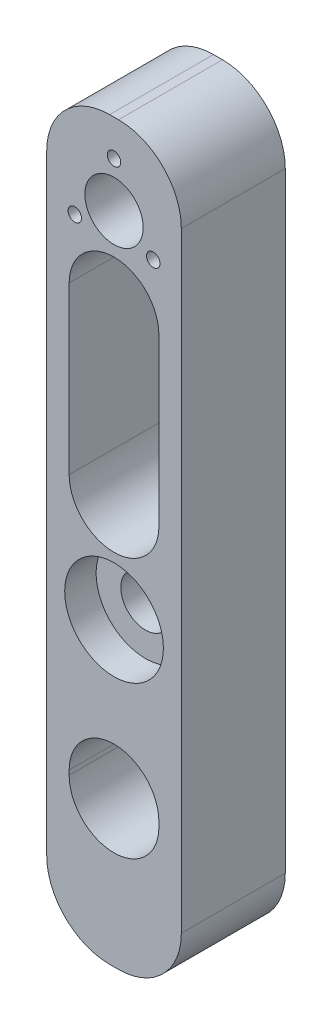
ISO-10303-21;
HEADER;
FILE_DESCRIPTION(('STEP AP214'),'2;1');
FILE_NAME('part.step','',(''),(''),'','','');
FILE_SCHEMA(('AUTOMOTIVE_DESIGN { 1 0 10303 214 1 1 1 1 }'));
ENDSEC;
DATA;
#1=APPLICATION_CONTEXT('core data for automotive mechanical design processes');
#2=APPLICATION_PROTOCOL_DEFINITION('international standard','automotive_design',2000,#1);
#3=PRODUCT_CONTEXT('',#1,'mechanical');
#4=PRODUCT('Part','Part','',(#3));
#5=PRODUCT_RELATED_PRODUCT_CATEGORY('part','',(#4));
#6=PRODUCT_DEFINITION_FORMATION('','',#4);
#7=PRODUCT_DEFINITION_CONTEXT('part definition',#1,'design');
#8=PRODUCT_DEFINITION('design','',#6,#7);
#9=PRODUCT_DEFINITION_SHAPE('','',#8);
#10=(LENGTH_UNIT() NAMED_UNIT(*) SI_UNIT(.MILLI.,.METRE.));
#11=(NAMED_UNIT(*) PLANE_ANGLE_UNIT() SI_UNIT($,.RADIAN.));
#12=(NAMED_UNIT(*) SI_UNIT($,.STERADIAN.) SOLID_ANGLE_UNIT());
#13=UNCERTAINTY_MEASURE_WITH_UNIT(LENGTH_MEASURE(1.E-05),#10,'distance_accuracy_value','');
#14=(GEOMETRIC_REPRESENTATION_CONTEXT(3) GLOBAL_UNCERTAINTY_ASSIGNED_CONTEXT((#13)) GLOBAL_UNIT_ASSIGNED_CONTEXT((#10,
#11,#12)) REPRESENTATION_CONTEXT('',''));
#15=CARTESIAN_POINT('',(0.,0.,0.));
#16=DIRECTION('',(0.,0.,1.));
#17=DIRECTION('',(1.,0.,0.));
#18=AXIS2_PLACEMENT_3D('',#15,#16,#17);
#19=CARTESIAN_POINT('',(0.,50.,23.1638));
#20=DIRECTION('',(0.,0.,-1.));
#21=DIRECTION('',(-1.,0.,0.));
#22=AXIS2_PLACEMENT_3D('',#19,#20,#21);
#23=CYLINDRICAL_SURFACE('',#22,11.);
#24=CARTESIAN_POINT('',(0.,50.,23.1638));
#25=DIRECTION('',(0.,0.,1.));
#26=DIRECTION('',(1.,0.,0.));
#27=AXIS2_PLACEMENT_3D('',#24,#25,#26);
#28=CIRCLE('',#27,11.);
#29=CARTESIAN_POINT('',(11.,50.,23.1638));
#30=VERTEX_POINT('',#29);
#31=EDGE_CURVE('E248',#30,#30,#28,.T.);
#32=ORIENTED_EDGE('',*,*,#31,.T.);
#33=EDGE_LOOP('',(#32));
#34=FACE_BOUND('',#33,.T.);
#35=CARTESIAN_POINT('',(0.,50.,16.1638));
#36=DIRECTION('',(0.,0.,-1.));
#37=DIRECTION('',(-1.,0.,0.));
#38=AXIS2_PLACEMENT_3D('',#35,#36,#37);
#39=CIRCLE('',#38,11.);
#40=CARTESIAN_POINT('',(-11.,50.,16.1638));
#41=VERTEX_POINT('',#40);
#42=EDGE_CURVE('E237',#41,#41,#39,.T.);
#43=ORIENTED_EDGE('',*,*,#42,.T.);
#44=EDGE_LOOP('',(#43));
#45=FACE_BOUND('',#44,.T.);
#46=ADVANCED_FACE('F33',(#34,#45),#23,.F.);
#47=CARTESIAN_POINT('',(0.,0.,23.1638));
#48=DIRECTION('',(0.,0.,1.));
#49=DIRECTION('',(1.,0.,0.));
#50=AXIS2_PLACEMENT_3D('',#47,#48,#49);
#51=PLANE('',#50);
#52=CARTESIAN_POINT('',(0.,110.,23.1638));
#53=DIRECTION('',(0.,0.,1.));
#54=DIRECTION('',(1.,0.,0.));
#55=AXIS2_PLACEMENT_3D('',#52,#53,#54);
#56=CIRCLE('',#55,10.);
#57=CARTESIAN_POINT('',(10.,110.,23.1638));
#58=VERTEX_POINT('',#57);
#59=CARTESIAN_POINT('',(-10.,110.,23.1638));
#60=VERTEX_POINT('',#59);
#61=EDGE_CURVE('E168',#58,#60,#56,.T.);
#62=ORIENTED_EDGE('',*,*,#61,.F.);
#63=DIRECTION('',(0.,1.,0.));
#64=VECTOR('',#63,1.);
#65=CARTESIAN_POINT('',(10.,110.,23.1638));
#66=LINE('',#65,#64);
#67=CARTESIAN_POINT('',(10.,73.,23.1638));
#68=VERTEX_POINT('',#67);
#69=EDGE_CURVE('E173',#68,#58,#66,.T.);
#70=ORIENTED_EDGE('',*,*,#69,.F.);
#71=CARTESIAN_POINT('',(0.,73.,23.1638));
#72=DIRECTION('',(0.,0.,1.));
#73=DIRECTION('',(1.,0.,0.));
#74=AXIS2_PLACEMENT_3D('',#71,#72,#73);
#75=CIRCLE('',#74,10.);
#76=CARTESIAN_POINT('',(-10.,73.,23.1638));
#77=VERTEX_POINT('',#76);
#78=EDGE_CURVE('E152',#77,#68,#75,.T.);
#79=ORIENTED_EDGE('',*,*,#78,.F.);
#80=DIRECTION('',(0.,-1.,0.));
#81=VECTOR('',#80,1.);
#82=CARTESIAN_POINT('',(-10.,110.,23.1638));
#83=LINE('',#82,#81);
#84=EDGE_CURVE('E163',#60,#77,#83,.T.);
#85=ORIENTED_EDGE('',*,*,#84,.F.);
#86=EDGE_LOOP('',(#62,#70,#79,#85));
#87=FACE_BOUND('',#86,.T.);
#88=CARTESIAN_POINT('',(0.,16.,23.1638));
#89=DIRECTION('',(0.,0.,1.));
#90=DIRECTION('',(1.,0.,0.));
#91=AXIS2_PLACEMENT_3D('',#88,#89,#90);
#92=CIRCLE('',#91,10.);
#93=CARTESIAN_POINT('',(10.,16.,23.1638));
#94=VERTEX_POINT('',#93);
#95=CARTESIAN_POINT('',(-10.,16.,23.1638));
#96=VERTEX_POINT('',#95);
#97=EDGE_CURVE('E195',#94,#96,#92,.T.);
#98=ORIENTED_EDGE('',*,*,#97,.F.);
#99=DIRECTION('',(0.,1.,0.));
#100=VECTOR('',#99,1.);
#101=CARTESIAN_POINT('',(10.,16.,23.1638));
#102=LINE('',#101,#100);
#103=CARTESIAN_POINT('',(10.,15.,23.1638));
#104=VERTEX_POINT('',#103);
#105=EDGE_CURVE('E203',#104,#94,#102,.T.);
#106=ORIENTED_EDGE('',*,*,#105,.F.);
#107=CARTESIAN_POINT('',(0.,15.,23.1638));
#108=DIRECTION('',(0.,0.,1.));
#109=DIRECTION('',(1.,0.,0.));
#110=AXIS2_PLACEMENT_3D('',#107,#108,#109);
#111=CIRCLE('',#110,10.);
#112=CARTESIAN_POINT('',(-10.,15.,23.1638));
#113=VERTEX_POINT('',#112);
#114=EDGE_CURVE('E200',#113,#104,#111,.T.);
#115=ORIENTED_EDGE('',*,*,#114,.F.);
#116=DIRECTION('',(0.,-1.,0.));
#117=VECTOR('',#116,1.);
#118=CARTESIAN_POINT('',(-10.,16.,23.1638));
#119=LINE('',#118,#117);
#120=EDGE_CURVE('E197',#96,#113,#119,.T.);
#121=ORIENTED_EDGE('',*,*,#120,.F.);
#122=EDGE_LOOP('',(#98,#106,#115,#121));
#123=FACE_BOUND('',#122,.T.);
#124=CARTESIAN_POINT('',(-8.75,123.844555433772,23.1638));
#125=DIRECTION('',(0.,0.,1.));
#126=DIRECTION('',(1.,0.,0.));
#127=AXIS2_PLACEMENT_3D('',#124,#125,#126);
#128=CIRCLE('',#127,1.5);
#129=CARTESIAN_POINT('',(-7.25,123.844555433772,23.1638));
#130=VERTEX_POINT('',#129);
#131=EDGE_CURVE('E215',#130,#130,#128,.T.);
#132=ORIENTED_EDGE('',*,*,#131,.F.);
#133=EDGE_LOOP('',(#132));
#134=FACE_BOUND('',#133,.T.);
#135=CARTESIAN_POINT('',(0.,128.896370289182,23.1638));
#136=DIRECTION('',(0.,0.,1.));
#137=DIRECTION('',(1.,0.,0.));
#138=AXIS2_PLACEMENT_3D('',#135,#136,#137);
#139=CIRCLE('',#138,6.5);
#140=CARTESIAN_POINT('',(6.5,128.896370289182,23.1638));
#141=VERTEX_POINT('',#140);
#142=EDGE_CURVE('E184',#141,#141,#139,.T.);
#143=ORIENTED_EDGE('',*,*,#142,.F.);
#144=EDGE_LOOP('',(#143));
#145=FACE_BOUND('',#144,.T.);
#146=CARTESIAN_POINT('',(0.,139.,23.1638));
#147=DIRECTION('',(0.,0.,1.));
#148=DIRECTION('',(1.,0.,0.));
#149=AXIS2_PLACEMENT_3D('',#146,#147,#148);
#150=CIRCLE('',#149,1.5);
#151=CARTESIAN_POINT('',(1.5,139.,23.1638));
#152=VERTEX_POINT('',#151);
#153=EDGE_CURVE('E222',#152,#152,#150,.T.);
#154=ORIENTED_EDGE('',*,*,#153,.F.);
#155=EDGE_LOOP('',(#154));
#156=FACE_BOUND('',#155,.T.);
#157=CARTESIAN_POINT('',(8.75,123.844555433772,23.1638));
#158=DIRECTION('',(0.,0.,1.));
#159=DIRECTION('',(1.,0.,0.));
#160=AXIS2_PLACEMENT_3D('',#157,#158,#159);
#161=CIRCLE('',#160,1.5);
#162=CARTESIAN_POINT('',(10.25,123.844555433772,23.1638));
#163=VERTEX_POINT('',#162);
#164=EDGE_CURVE('E219',#163,#163,#161,.T.);
#165=ORIENTED_EDGE('',*,*,#164,.F.);
#166=EDGE_LOOP('',(#165));
#167=FACE_BOUND('',#166,.T.);
#168=DIRECTION('',(0.,1.,0.));
#169=VECTOR('',#168,1.);
#170=CARTESIAN_POINT('',(15.,67.,23.1638));
#171=LINE('',#170,#169);
#172=CARTESIAN_POINT('',(15.,-2.99999999999998,23.1638));
#173=VERTEX_POINT('',#172);
#174=CARTESIAN_POINT('',(15.,133.,23.1638));
#175=VERTEX_POINT('',#174);
#176=EDGE_CURVE('E258',#173,#175,#171,.T.);
#177=ORIENTED_EDGE('',*,*,#176,.T.);
#178=CARTESIAN_POINT('',(0.999999999999983,133.,23.1638));
#179=DIRECTION('',(0.,0.,1.));
#180=DIRECTION('',(1.,0.,0.));
#181=AXIS2_PLACEMENT_3D('',#178,#179,#180);
#182=CIRCLE('',#181,14.);
#183=CARTESIAN_POINT('',(0.999999999999984,147.,23.1638));
#184=VERTEX_POINT('',#183);
#185=EDGE_CURVE('E302',#175,#184,#182,.T.);
#186=ORIENTED_EDGE('',*,*,#185,.T.);
#187=DIRECTION('',(-1.,0.,0.));
#188=VECTOR('',#187,1.);
#189=CARTESIAN_POINT('',(-15.,147.,23.1638));
#190=LINE('',#189,#188);
#191=CARTESIAN_POINT('',(-1.00000000000002,147.,23.1638));
#192=VERTEX_POINT('',#191);
#193=EDGE_CURVE('E230',#184,#192,#190,.T.);
#194=ORIENTED_EDGE('',*,*,#193,.T.);
#195=CARTESIAN_POINT('',(-1.00000000000002,133.,23.1638));
#196=DIRECTION('',(0.,0.,1.));
#197=DIRECTION('',(1.,0.,0.));
#198=AXIS2_PLACEMENT_3D('',#195,#196,#197);
#199=CIRCLE('',#198,14.);
#200=CARTESIAN_POINT('',(-15.,133.,23.1638));
#201=VERTEX_POINT('',#200);
#202=EDGE_CURVE('E300',#192,#201,#199,.T.);
#203=ORIENTED_EDGE('',*,*,#202,.T.);
#204=DIRECTION('',(0.,-1.,0.));
#205=VECTOR('',#204,1.);
#206=CARTESIAN_POINT('',(-15.,67.,23.1638));
#207=LINE('',#206,#205);
#208=CARTESIAN_POINT('',(-15.,-2.99999999999998,23.1638));
#209=VERTEX_POINT('',#208);
#210=EDGE_CURVE('E252',#201,#209,#207,.T.);
#211=ORIENTED_EDGE('',*,*,#210,.T.);
#212=CARTESIAN_POINT('',(-1.,-3.,23.1638));
#213=DIRECTION('',(0.,0.,1.));
#214=DIRECTION('',(1.,0.,0.));
#215=AXIS2_PLACEMENT_3D('',#212,#213,#214);
#216=CIRCLE('',#215,14.);
#217=CARTESIAN_POINT('',(-1.,-17.,23.1638));
#218=VERTEX_POINT('',#217);
#219=EDGE_CURVE('E282',#209,#218,#216,.T.);
#220=ORIENTED_EDGE('',*,*,#219,.T.);
#221=DIRECTION('',(1.,0.,0.));
#222=VECTOR('',#221,1.);
#223=CARTESIAN_POINT('',(-15.,-17.,23.1638));
#224=LINE('',#223,#222);
#225=CARTESIAN_POINT('',(0.999999999999987,-17.,23.1638));
#226=VERTEX_POINT('',#225);
#227=EDGE_CURVE('E254',#218,#226,#224,.T.);
#228=ORIENTED_EDGE('',*,*,#227,.T.);
#229=CARTESIAN_POINT('',(0.999999999999995,-3.,23.1638));
#230=DIRECTION('',(0.,0.,1.));
#231=DIRECTION('',(1.,0.,0.));
#232=AXIS2_PLACEMENT_3D('',#229,#230,#231);
#233=CIRCLE('',#232,14.);
#234=EDGE_CURVE('E280',#226,#173,#233,.T.);
#235=ORIENTED_EDGE('',*,*,#234,.T.);
#236=EDGE_LOOP('',(#177,#186,#194,#203,#211,#220,#228,#235));
#237=FACE_BOUND('',#236,.T.);
#238=ORIENTED_EDGE('',*,*,#31,.F.);
#239=EDGE_LOOP('',(#238));
#240=FACE_BOUND('',#239,.T.);
#241=ADVANCED_FACE('F170',(#87,#123,#134,#145,#156,#167,#237,#240),#51,.T.);
#242=CARTESIAN_POINT('',(0.,0.,0.));
#243=DIRECTION('',(0.,0.,1.));
#244=DIRECTION('',(1.,0.,0.));
#245=AXIS2_PLACEMENT_3D('',#242,#243,#244);
#246=PLANE('',#245);
#247=DIRECTION('',(0.,-1.,0.));
#248=VECTOR('',#247,1.);
#249=CARTESIAN_POINT('',(10.,110.,0.));
#250=LINE('',#249,#248);
#251=CARTESIAN_POINT('',(10.,110.,0.));
#252=VERTEX_POINT('',#251);
#253=CARTESIAN_POINT('',(10.,73.,0.));
#254=VERTEX_POINT('',#253);
#255=EDGE_CURVE('E612',#252,#254,#250,.T.);
#256=ORIENTED_EDGE('',*,*,#255,.F.);
#257=CARTESIAN_POINT('',(0.,110.,0.));
#258=DIRECTION('',(0.,0.,1.));
#259=DIRECTION('',(1.,0.,0.));
#260=AXIS2_PLACEMENT_3D('',#257,#258,#259);
#261=CIRCLE('',#260,10.);
#262=CARTESIAN_POINT('',(-10.,110.,0.));
#263=VERTEX_POINT('',#262);
#264=EDGE_CURVE('E185',#263,#252,#261,.F.);
#265=ORIENTED_EDGE('',*,*,#264,.F.);
#266=DIRECTION('',(0.,1.,0.));
#267=VECTOR('',#266,1.);
#268=CARTESIAN_POINT('',(-10.,110.,0.));
#269=LINE('',#268,#267);
#270=CARTESIAN_POINT('',(-10.,73.,0.));
#271=VERTEX_POINT('',#270);
#272=EDGE_CURVE('E182',#271,#263,#269,.T.);
#273=ORIENTED_EDGE('',*,*,#272,.F.);
#274=CARTESIAN_POINT('',(0.,73.,0.));
#275=DIRECTION('',(0.,0.,1.));
#276=DIRECTION('',(1.,0.,0.));
#277=AXIS2_PLACEMENT_3D('',#274,#275,#276);
#278=CIRCLE('',#277,10.);
#279=EDGE_CURVE('E155',#254,#271,#278,.F.);
#280=ORIENTED_EDGE('',*,*,#279,.F.);
#281=EDGE_LOOP('',(#256,#265,#273,#280));
#282=FACE_BOUND('',#281,.T.);
#283=DIRECTION('',(0.,-1.,0.));
#284=VECTOR('',#283,1.);
#285=CARTESIAN_POINT('',(10.,16.,0.));
#286=LINE('',#285,#284);
#287=CARTESIAN_POINT('',(10.,16.,0.));
#288=VERTEX_POINT('',#287);
#289=CARTESIAN_POINT('',(10.,15.,0.));
#290=VERTEX_POINT('',#289);
#291=EDGE_CURVE('E189',#288,#290,#286,.T.);
#292=ORIENTED_EDGE('',*,*,#291,.F.);
#293=CARTESIAN_POINT('',(0.,16.,0.));
#294=DIRECTION('',(0.,0.,1.));
#295=DIRECTION('',(1.,0.,0.));
#296=AXIS2_PLACEMENT_3D('',#293,#294,#295);
#297=CIRCLE('',#296,10.);
#298=CARTESIAN_POINT('',(-10.,16.,0.));
#299=VERTEX_POINT('',#298);
#300=EDGE_CURVE('E192',#299,#288,#297,.F.);
#301=ORIENTED_EDGE('',*,*,#300,.F.);
#302=DIRECTION('',(0.,1.,0.));
#303=VECTOR('',#302,1.);
#304=CARTESIAN_POINT('',(-10.,16.,0.));
#305=LINE('',#304,#303);
#306=CARTESIAN_POINT('',(-10.,15.,0.));
#307=VERTEX_POINT('',#306);
#308=EDGE_CURVE('E194',#307,#299,#305,.T.);
#309=ORIENTED_EDGE('',*,*,#308,.F.);
#310=CARTESIAN_POINT('',(0.,15.,0.));
#311=DIRECTION('',(0.,0.,1.));
#312=DIRECTION('',(1.,0.,0.));
#313=AXIS2_PLACEMENT_3D('',#310,#311,#312);
#314=CIRCLE('',#313,10.);
#315=EDGE_CURVE('E186',#290,#307,#314,.F.);
#316=ORIENTED_EDGE('',*,*,#315,.F.);
#317=EDGE_LOOP('',(#292,#301,#309,#316));
#318=FACE_BOUND('',#317,.T.);
#319=CARTESIAN_POINT('',(-8.75,123.844555433772,0.));
#320=DIRECTION('',(0.,0.,1.));
#321=DIRECTION('',(1.,0.,0.));
#322=AXIS2_PLACEMENT_3D('',#319,#320,#321);
#323=CIRCLE('',#322,1.5);
#324=CARTESIAN_POINT('',(-7.25,123.844555433772,0.));
#325=VERTEX_POINT('',#324);
#326=EDGE_CURVE('E233',#325,#325,#323,.T.);
#327=ORIENTED_EDGE('',*,*,#326,.T.);
#328=EDGE_LOOP('',(#327));
#329=FACE_BOUND('',#328,.T.);
#330=CARTESIAN_POINT('',(0.,128.896370289182,0.));
#331=DIRECTION('',(0.,0.,1.));
#332=DIRECTION('',(1.,0.,0.));
#333=AXIS2_PLACEMENT_3D('',#330,#331,#332);
#334=CIRCLE('',#333,6.5);
#335=CARTESIAN_POINT('',(6.5,128.896370289182,0.));
#336=VERTEX_POINT('',#335);
#337=EDGE_CURVE('E293',#336,#336,#334,.T.);
#338=ORIENTED_EDGE('',*,*,#337,.T.);
#339=EDGE_LOOP('',(#338));
#340=FACE_BOUND('',#339,.T.);
#341=CARTESIAN_POINT('',(0.,139.,0.));
#342=DIRECTION('',(0.,0.,1.));
#343=DIRECTION('',(1.,0.,0.));
#344=AXIS2_PLACEMENT_3D('',#341,#342,#343);
#345=CIRCLE('',#344,1.5);
#346=CARTESIAN_POINT('',(1.5,139.,0.));
#347=VERTEX_POINT('',#346);
#348=EDGE_CURVE('E290',#347,#347,#345,.T.);
#349=ORIENTED_EDGE('',*,*,#348,.T.);
#350=EDGE_LOOP('',(#349));
#351=FACE_BOUND('',#350,.T.);
#352=CARTESIAN_POINT('',(8.75,123.844555433772,0.));
#353=DIRECTION('',(0.,0.,1.));
#354=DIRECTION('',(1.,0.,0.));
#355=AXIS2_PLACEMENT_3D('',#352,#353,#354);
#356=CIRCLE('',#355,1.5);
#357=CARTESIAN_POINT('',(10.25,123.844555433772,0.));
#358=VERTEX_POINT('',#357);
#359=EDGE_CURVE('E218',#358,#358,#356,.T.);
#360=ORIENTED_EDGE('',*,*,#359,.T.);
#361=EDGE_LOOP('',(#360));
#362=FACE_BOUND('',#361,.T.);
#363=DIRECTION('',(1.,0.,0.));
#364=VECTOR('',#363,1.);
#365=CARTESIAN_POINT('',(-15.,147.,0.));
#366=LINE('',#365,#364);
#367=CARTESIAN_POINT('',(-1.00000000000002,147.,0.));
#368=VERTEX_POINT('',#367);
#369=CARTESIAN_POINT('',(0.999999999999984,147.,0.));
#370=VERTEX_POINT('',#369);
#371=EDGE_CURVE('E227',#368,#370,#366,.T.);
#372=ORIENTED_EDGE('',*,*,#371,.T.);
#373=CARTESIAN_POINT('',(0.999999999999983,133.,0.));
#374=DIRECTION('',(0.,0.,1.));
#375=DIRECTION('',(1.,0.,0.));
#376=AXIS2_PLACEMENT_3D('',#373,#374,#375);
#377=CIRCLE('',#376,14.);
#378=CARTESIAN_POINT('',(15.,133.,0.));
#379=VERTEX_POINT('',#378);
#380=EDGE_CURVE('E41',#370,#379,#377,.F.);
#381=ORIENTED_EDGE('',*,*,#380,.T.);
#382=DIRECTION('',(0.,1.,0.));
#383=VECTOR('',#382,1.);
#384=CARTESIAN_POINT('',(15.,67.,0.));
#385=LINE('',#384,#383);
#386=CARTESIAN_POINT('',(15.,-2.99999999999998,0.));
#387=VERTEX_POINT('',#386);
#388=EDGE_CURVE('E255',#387,#379,#385,.T.);
#389=ORIENTED_EDGE('',*,*,#388,.F.);
#390=CARTESIAN_POINT('',(0.999999999999995,-3.,0.));
#391=DIRECTION('',(0.,0.,1.));
#392=DIRECTION('',(1.,0.,0.));
#393=AXIS2_PLACEMENT_3D('',#390,#391,#392);
#394=CIRCLE('',#393,14.);
#395=CARTESIAN_POINT('',(0.999999999999987,-17.,0.));
#396=VERTEX_POINT('',#395);
#397=EDGE_CURVE('E272',#387,#396,#394,.F.);
#398=ORIENTED_EDGE('',*,*,#397,.T.);
#399=DIRECTION('',(1.,0.,0.));
#400=VECTOR('',#399,1.);
#401=CARTESIAN_POINT('',(-15.,-17.,0.));
#402=LINE('',#401,#400);
#403=CARTESIAN_POINT('',(-1.,-17.,0.));
#404=VERTEX_POINT('',#403);
#405=EDGE_CURVE('E263',#404,#396,#402,.T.);
#406=ORIENTED_EDGE('',*,*,#405,.F.);
#407=CARTESIAN_POINT('',(-1.,-3.,0.));
#408=DIRECTION('',(0.,0.,1.));
#409=DIRECTION('',(1.,0.,0.));
#410=AXIS2_PLACEMENT_3D('',#407,#408,#409);
#411=CIRCLE('',#410,14.);
#412=CARTESIAN_POINT('',(-15.,-2.99999999999998,0.));
#413=VERTEX_POINT('',#412);
#414=EDGE_CURVE('E274',#404,#413,#411,.F.);
#415=ORIENTED_EDGE('',*,*,#414,.T.);
#416=DIRECTION('',(0.,-1.,0.));
#417=VECTOR('',#416,1.);
#418=CARTESIAN_POINT('',(-15.,67.,0.));
#419=LINE('',#418,#417);
#420=CARTESIAN_POINT('',(-15.,133.,0.));
#421=VERTEX_POINT('',#420);
#422=EDGE_CURVE('E251',#421,#413,#419,.T.);
#423=ORIENTED_EDGE('',*,*,#422,.F.);
#424=CARTESIAN_POINT('',(-1.00000000000002,133.,0.));
#425=DIRECTION('',(0.,0.,1.));
#426=DIRECTION('',(1.,0.,0.));
#427=AXIS2_PLACEMENT_3D('',#424,#425,#426);
#428=CIRCLE('',#427,14.);
#429=EDGE_CURVE('E308',#421,#368,#428,.F.);
#430=ORIENTED_EDGE('',*,*,#429,.T.);
#431=EDGE_LOOP('',(#372,#381,#389,#398,#406,#415,#423,#430));
#432=FACE_BOUND('',#431,.T.);
#433=CARTESIAN_POINT('',(0.,0.,0.));
#434=DIRECTION('',(0.,0.,1.));
#435=DIRECTION('',(1.,0.,0.));
#436=AXIS2_PLACEMENT_3D('',#433,#434,#435);
#437=CIRCLE('',#436,4.);
#438=CARTESIAN_POINT('',(4.,0.,0.));
#439=VERTEX_POINT('',#438);
#440=EDGE_CURVE('E245',#439,#439,#437,.F.);
#441=ORIENTED_EDGE('',*,*,#440,.F.);
#442=EDGE_LOOP('',(#441));
#443=FACE_BOUND('',#442,.T.);
#444=CARTESIAN_POINT('',(0.,50.,0.));
#445=DIRECTION('',(0.,0.,-1.));
#446=DIRECTION('',(-1.,0.,0.));
#447=AXIS2_PLACEMENT_3D('',#444,#445,#446);
#448=CIRCLE('',#447,5.5);
#449=CARTESIAN_POINT('',(-5.5,50.,0.));
#450=VERTEX_POINT('',#449);
#451=EDGE_CURVE('E229',#450,#450,#448,.T.);
#452=ORIENTED_EDGE('',*,*,#451,.F.);
#453=EDGE_LOOP('',(#452));
#454=FACE_BOUND('',#453,.T.);
#455=ADVANCED_FACE('F312',(#282,#318,#329,#340,#351,#362,#432,#443,#454),#246,.F.);
#456=CARTESIAN_POINT('',(-15.,67.,23.1638));
#457=DIRECTION('',(1.,0.,0.));
#458=DIRECTION('',(0.,1.,0.));
#459=AXIS2_PLACEMENT_3D('',#456,#457,#458);
#460=PLANE('',#459);
#461=ORIENTED_EDGE('',*,*,#210,.F.);
#462=DIRECTION('',(0.,0.,1.));
#463=VECTOR('',#462,1.);
#464=CARTESIAN_POINT('',(-15.,133.,0.));
#465=LINE('',#464,#463);
#466=EDGE_CURVE('E11',#201,#421,#465,.F.);
#467=ORIENTED_EDGE('',*,*,#466,.T.);
#468=ORIENTED_EDGE('',*,*,#422,.T.);
#469=DIRECTION('',(0.,0.,-1.));
#470=VECTOR('',#469,1.);
#471=CARTESIAN_POINT('',(-15.,-3.,23.1638));
#472=LINE('',#471,#470);
#473=EDGE_CURVE('E277',#413,#209,#472,.F.);
#474=ORIENTED_EDGE('',*,*,#473,.T.);
#475=EDGE_LOOP('',(#461,#467,#468,#474));
#476=FACE_BOUND('',#475,.T.);
#477=ADVANCED_FACE('F327',(#476),#460,.F.);
#478=CARTESIAN_POINT('',(-15.,-17.,23.1638));
#479=DIRECTION('',(0.,1.,0.));
#480=DIRECTION('',(0.,0.,1.));
#481=AXIS2_PLACEMENT_3D('',#478,#479,#480);
#482=PLANE('',#481);
#483=ORIENTED_EDGE('',*,*,#227,.F.);
#484=DIRECTION('',(0.,0.,-1.));
#485=VECTOR('',#484,1.);
#486=CARTESIAN_POINT('',(-1.,-17.,23.1638));
#487=LINE('',#486,#485);
#488=EDGE_CURVE('E269',#218,#404,#487,.T.);
#489=ORIENTED_EDGE('',*,*,#488,.T.);
#490=ORIENTED_EDGE('',*,*,#405,.T.);
#491=DIRECTION('',(0.,0.,-1.));
#492=VECTOR('',#491,1.);
#493=CARTESIAN_POINT('',(0.999999999999994,-17.,23.1638));
#494=LINE('',#493,#492);
#495=EDGE_CURVE('E261',#396,#226,#494,.F.);
#496=ORIENTED_EDGE('',*,*,#495,.T.);
#497=EDGE_LOOP('',(#483,#489,#490,#496));
#498=FACE_BOUND('',#497,.T.);
#499=ADVANCED_FACE('F336',(#498),#482,.F.);
#500=CARTESIAN_POINT('',(15.,67.,23.1638));
#501=DIRECTION('',(-1.,0.,0.));
#502=DIRECTION('',(0.,-1.,0.));
#503=AXIS2_PLACEMENT_3D('',#500,#501,#502);
#504=PLANE('',#503);
#505=ORIENTED_EDGE('',*,*,#388,.T.);
#506=DIRECTION('',(0.,0.,1.));
#507=VECTOR('',#506,1.);
#508=CARTESIAN_POINT('',(15.,133.,23.1638));
#509=LINE('',#508,#507);
#510=EDGE_CURVE('E287',#379,#175,#509,.T.);
#511=ORIENTED_EDGE('',*,*,#510,.T.);
#512=ORIENTED_EDGE('',*,*,#176,.F.);
#513=DIRECTION('',(0.,0.,-1.));
#514=VECTOR('',#513,1.);
#515=CARTESIAN_POINT('',(15.,-3.,23.1638));
#516=LINE('',#515,#514);
#517=EDGE_CURVE('E284',#173,#387,#516,.T.);
#518=ORIENTED_EDGE('',*,*,#517,.T.);
#519=EDGE_LOOP('',(#505,#511,#512,#518));
#520=FACE_BOUND('',#519,.T.);
#521=ADVANCED_FACE('F317',(#520),#504,.F.);
#522=CARTESIAN_POINT('',(0.,0.,-9.));
#523=DIRECTION('',(0.,0.,1.));
#524=DIRECTION('',(1.,0.,0.));
#525=AXIS2_PLACEMENT_3D('',#522,#523,#524);
#526=CYLINDRICAL_SURFACE('',#525,4.);
#527=CARTESIAN_POINT('',(0.,0.,-9.));
#528=DIRECTION('',(0.,0.,1.));
#529=DIRECTION('',(1.,0.,0.));
#530=AXIS2_PLACEMENT_3D('',#527,#528,#529);
#531=CIRCLE('',#530,4.);
#532=CARTESIAN_POINT('',(4.,0.,-9.));
#533=VERTEX_POINT('',#532);
#534=EDGE_CURVE('E242',#533,#533,#531,.T.);
#535=ORIENTED_EDGE('',*,*,#534,.T.);
#536=EDGE_LOOP('',(#535));
#537=FACE_BOUND('',#536,.T.);
#538=ORIENTED_EDGE('',*,*,#440,.T.);
#539=EDGE_LOOP('',(#538));
#540=FACE_BOUND('',#539,.T.);
#541=ADVANCED_FACE('F360',(#537,#540),#526,.T.);
#542=CARTESIAN_POINT('',(0.,0.,-9.));
#543=DIRECTION('',(0.,0.,1.));
#544=DIRECTION('',(1.,0.,0.));
#545=AXIS2_PLACEMENT_3D('',#542,#543,#544);
#546=PLANE('',#545);
#547=ORIENTED_EDGE('',*,*,#534,.F.);
#548=EDGE_LOOP('',(#547));
#549=FACE_BOUND('',#548,.T.);
#550=ADVANCED_FACE('F392',(#549),#546,.F.);
#551=CARTESIAN_POINT('',(0.,50.,16.1638));
#552=DIRECTION('',(0.,0.,-1.));
#553=DIRECTION('',(-1.,0.,0.));
#554=AXIS2_PLACEMENT_3D('',#551,#552,#553);
#555=PLANE('',#554);
#556=CARTESIAN_POINT('',(0.,50.,16.1638));
#557=DIRECTION('',(0.,0.,-1.));
#558=DIRECTION('',(-1.,0.,0.));
#559=AXIS2_PLACEMENT_3D('',#556,#557,#558);
#560=CIRCLE('',#559,5.5);
#561=CARTESIAN_POINT('',(-5.5,50.,16.1638));
#562=VERTEX_POINT('',#561);
#563=EDGE_CURVE('E234',#562,#562,#560,.T.);
#564=ORIENTED_EDGE('',*,*,#563,.T.);
#565=EDGE_LOOP('',(#564));
#566=FACE_BOUND('',#565,.T.);
#567=ORIENTED_EDGE('',*,*,#42,.F.);
#568=EDGE_LOOP('',(#567));
#569=FACE_BOUND('',#568,.T.);
#570=ADVANCED_FACE('F399',(#566,#569),#555,.F.);
#571=CARTESIAN_POINT('',(0.,50.,16.1638));
#572=DIRECTION('',(0.,0.,-1.));
#573=DIRECTION('',(-1.,0.,0.));
#574=AXIS2_PLACEMENT_3D('',#571,#572,#573);
#575=CYLINDRICAL_SURFACE('',#574,5.5);
#576=ORIENTED_EDGE('',*,*,#563,.F.);
#577=EDGE_LOOP('',(#576));
#578=FACE_BOUND('',#577,.T.);
#579=ORIENTED_EDGE('',*,*,#451,.T.);
#580=EDGE_LOOP('',(#579));
#581=FACE_BOUND('',#580,.T.);
#582=ADVANCED_FACE('F349',(#578,#581),#575,.F.);
#583=CARTESIAN_POINT('',(-1.,-3.,23.1638));
#584=DIRECTION('',(0.,0.,-1.));
#585=DIRECTION('',(-1.,0.,0.));
#586=AXIS2_PLACEMENT_3D('',#583,#584,#585);
#587=CYLINDRICAL_SURFACE('',#586,14.);
#588=ORIENTED_EDGE('',*,*,#219,.F.);
#589=ORIENTED_EDGE('',*,*,#473,.F.);
#590=ORIENTED_EDGE('',*,*,#414,.F.);
#591=ORIENTED_EDGE('',*,*,#488,.F.);
#592=EDGE_LOOP('',(#588,#589,#590,#591));
#593=FACE_BOUND('',#592,.T.);
#594=ADVANCED_FACE('F332',(#593),#587,.T.);
#595=CARTESIAN_POINT('',(0.999999999999995,-3.,23.1638));
#596=DIRECTION('',(0.,0.,-1.));
#597=DIRECTION('',(-1.,0.,0.));
#598=AXIS2_PLACEMENT_3D('',#595,#596,#597);
#599=CYLINDRICAL_SURFACE('',#598,14.);
#600=ORIENTED_EDGE('',*,*,#234,.F.);
#601=ORIENTED_EDGE('',*,*,#495,.F.);
#602=ORIENTED_EDGE('',*,*,#397,.F.);
#603=ORIENTED_EDGE('',*,*,#517,.F.);
#604=EDGE_LOOP('',(#600,#601,#602,#603));
#605=FACE_BOUND('',#604,.T.);
#606=ADVANCED_FACE('F340',(#605),#599,.T.);
#607=CARTESIAN_POINT('',(-15.,147.,-85.4400374531753));
#608=DIRECTION('',(0.,1.,0.));
#609=DIRECTION('',(0.,0.,1.));
#610=AXIS2_PLACEMENT_3D('',#607,#608,#609);
#611=PLANE('',#610);
#612=ORIENTED_EDGE('',*,*,#193,.F.);
#613=DIRECTION('',(0.,0.,1.));
#614=VECTOR('',#613,1.);
#615=CARTESIAN_POINT('',(0.999999999999983,147.,0.));
#616=LINE('',#615,#614);
#617=EDGE_CURVE('E54',#184,#370,#616,.F.);
#618=ORIENTED_EDGE('',*,*,#617,.T.);
#619=ORIENTED_EDGE('',*,*,#371,.F.);
#620=DIRECTION('',(0.,0.,1.));
#621=VECTOR('',#620,1.);
#622=CARTESIAN_POINT('',(-1.00000000000002,147.,23.1638));
#623=LINE('',#622,#621);
#624=EDGE_CURVE('E304',#368,#192,#623,.T.);
#625=ORIENTED_EDGE('',*,*,#624,.T.);
#626=EDGE_LOOP('',(#612,#618,#619,#625));
#627=FACE_BOUND('',#626,.T.);
#628=ADVANCED_FACE('F323',(#627),#611,.T.);
#629=CARTESIAN_POINT('',(8.75,123.844555433772,-9.));
#630=DIRECTION('',(0.,0.,1.));
#631=DIRECTION('',(1.,0.,0.));
#632=AXIS2_PLACEMENT_3D('',#629,#630,#631);
#633=CYLINDRICAL_SURFACE('',#632,1.5);
#634=ORIENTED_EDGE('',*,*,#164,.T.);
#635=EDGE_LOOP('',(#634));
#636=FACE_BOUND('',#635,.T.);
#637=ORIENTED_EDGE('',*,*,#359,.F.);
#638=EDGE_LOOP('',(#637));
#639=FACE_BOUND('',#638,.T.);
#640=ADVANCED_FACE('F347',(#636,#639),#633,.F.);
#641=CARTESIAN_POINT('',(0.,139.,-9.));
#642=DIRECTION('',(0.,0.,1.));
#643=DIRECTION('',(1.,0.,0.));
#644=AXIS2_PLACEMENT_3D('',#641,#642,#643);
#645=CYLINDRICAL_SURFACE('',#644,1.5);
#646=ORIENTED_EDGE('',*,*,#153,.T.);
#647=EDGE_LOOP('',(#646));
#648=FACE_BOUND('',#647,.T.);
#649=ORIENTED_EDGE('',*,*,#348,.F.);
#650=EDGE_LOOP('',(#649));
#651=FACE_BOUND('',#650,.T.);
#652=ADVANCED_FACE('F430',(#648,#651),#645,.F.);
#653=CARTESIAN_POINT('',(0.,128.896370289182,-9.));
#654=DIRECTION('',(0.,0.,1.));
#655=DIRECTION('',(1.,0.,0.));
#656=AXIS2_PLACEMENT_3D('',#653,#654,#655);
#657=CYLINDRICAL_SURFACE('',#656,6.5);
#658=ORIENTED_EDGE('',*,*,#142,.T.);
#659=EDGE_LOOP('',(#658));
#660=FACE_BOUND('',#659,.T.);
#661=ORIENTED_EDGE('',*,*,#337,.F.);
#662=EDGE_LOOP('',(#661));
#663=FACE_BOUND('',#662,.T.);
#664=ADVANCED_FACE('F441',(#660,#663),#657,.F.);
#665=CARTESIAN_POINT('',(-8.75,123.844555433772,-9.));
#666=DIRECTION('',(0.,0.,1.));
#667=DIRECTION('',(1.,0.,0.));
#668=AXIS2_PLACEMENT_3D('',#665,#666,#667);
#669=CYLINDRICAL_SURFACE('',#668,1.5);
#670=ORIENTED_EDGE('',*,*,#131,.T.);
#671=EDGE_LOOP('',(#670));
#672=FACE_BOUND('',#671,.T.);
#673=ORIENTED_EDGE('',*,*,#326,.F.);
#674=EDGE_LOOP('',(#673));
#675=FACE_BOUND('',#674,.T.);
#676=ADVANCED_FACE('F451',(#672,#675),#669,.F.);
#677=CARTESIAN_POINT('',(0.,16.,-60.4069532421558));
#678=DIRECTION('',(0.,0.,1.));
#679=DIRECTION('',(1.,0.,0.));
#680=AXIS2_PLACEMENT_3D('',#677,#678,#679);
#681=CYLINDRICAL_SURFACE('',#680,10.);
#682=ORIENTED_EDGE('',*,*,#300,.T.);
#683=DIRECTION('',(0.,0.,1.));
#684=VECTOR('',#683,1.);
#685=CARTESIAN_POINT('',(10.,16.,-60.4069532421558));
#686=LINE('',#685,#684);
#687=EDGE_CURVE('E190',#288,#94,#686,.T.);
#688=ORIENTED_EDGE('',*,*,#687,.T.);
#689=ORIENTED_EDGE('',*,*,#97,.T.);
#690=DIRECTION('',(0.,0.,1.));
#691=VECTOR('',#690,1.);
#692=CARTESIAN_POINT('',(-10.,16.,-60.4069532421558));
#693=LINE('',#692,#691);
#694=EDGE_CURVE('E206',#299,#96,#693,.T.);
#695=ORIENTED_EDGE('',*,*,#694,.F.);
#696=EDGE_LOOP('',(#682,#688,#689,#695));
#697=FACE_BOUND('',#696,.T.);
#698=ADVANCED_FACE('F461',(#697),#681,.F.);
#699=CARTESIAN_POINT('',(10.,16.,-60.4069532421558));
#700=DIRECTION('',(1.,0.,0.));
#701=DIRECTION('',(0.,1.,0.));
#702=AXIS2_PLACEMENT_3D('',#699,#700,#701);
#703=PLANE('',#702);
#704=ORIENTED_EDGE('',*,*,#291,.T.);
#705=DIRECTION('',(0.,0.,1.));
#706=VECTOR('',#705,1.);
#707=CARTESIAN_POINT('',(10.,15.,-60.4069532421558));
#708=LINE('',#707,#706);
#709=EDGE_CURVE('E208',#290,#104,#708,.T.);
#710=ORIENTED_EDGE('',*,*,#709,.T.);
#711=ORIENTED_EDGE('',*,*,#105,.T.);
#712=ORIENTED_EDGE('',*,*,#687,.F.);
#713=EDGE_LOOP('',(#704,#710,#711,#712));
#714=FACE_BOUND('',#713,.T.);
#715=ADVANCED_FACE('F471',(#714),#703,.F.);
#716=CARTESIAN_POINT('',(0.,15.,-60.4069532421558));
#717=DIRECTION('',(0.,0.,1.));
#718=DIRECTION('',(1.,0.,0.));
#719=AXIS2_PLACEMENT_3D('',#716,#717,#718);
#720=CYLINDRICAL_SURFACE('',#719,10.);
#721=ORIENTED_EDGE('',*,*,#315,.T.);
#722=DIRECTION('',(0.,0.,1.));
#723=VECTOR('',#722,1.);
#724=CARTESIAN_POINT('',(-10.,15.,-60.4069532421558));
#725=LINE('',#724,#723);
#726=EDGE_CURVE('E210',#307,#113,#725,.T.);
#727=ORIENTED_EDGE('',*,*,#726,.T.);
#728=ORIENTED_EDGE('',*,*,#114,.T.);
#729=ORIENTED_EDGE('',*,*,#709,.F.);
#730=EDGE_LOOP('',(#721,#727,#728,#729));
#731=FACE_BOUND('',#730,.T.);
#732=ADVANCED_FACE('F481',(#731),#720,.F.);
#733=CARTESIAN_POINT('',(-10.,16.,-60.4069532421558));
#734=DIRECTION('',(-1.,0.,0.));
#735=DIRECTION('',(0.,-1.,0.));
#736=AXIS2_PLACEMENT_3D('',#733,#734,#735);
#737=PLANE('',#736);
#738=ORIENTED_EDGE('',*,*,#308,.T.);
#739=ORIENTED_EDGE('',*,*,#694,.T.);
#740=ORIENTED_EDGE('',*,*,#120,.T.);
#741=ORIENTED_EDGE('',*,*,#726,.F.);
#742=EDGE_LOOP('',(#738,#739,#740,#741));
#743=FACE_BOUND('',#742,.T.);
#744=ADVANCED_FACE('F491',(#743),#737,.F.);
#745=CARTESIAN_POINT('',(0.,110.,-60.4069532421558));
#746=DIRECTION('',(0.,0.,1.));
#747=DIRECTION('',(1.,0.,0.));
#748=AXIS2_PLACEMENT_3D('',#745,#746,#747);
#749=CYLINDRICAL_SURFACE('',#748,10.);
#750=ORIENTED_EDGE('',*,*,#264,.T.);
#751=DIRECTION('',(0.,0.,1.));
#752=VECTOR('',#751,1.);
#753=CARTESIAN_POINT('',(10.,110.,-60.4069532421558));
#754=LINE('',#753,#752);
#755=EDGE_CURVE('E178',#252,#58,#754,.T.);
#756=ORIENTED_EDGE('',*,*,#755,.T.);
#757=ORIENTED_EDGE('',*,*,#61,.T.);
#758=DIRECTION('',(0.,0.,1.));
#759=VECTOR('',#758,1.);
#760=CARTESIAN_POINT('',(-10.,110.,-60.4069532421558));
#761=LINE('',#760,#759);
#762=EDGE_CURVE('E159',#263,#60,#761,.T.);
#763=ORIENTED_EDGE('',*,*,#762,.F.);
#764=EDGE_LOOP('',(#750,#756,#757,#763));
#765=FACE_BOUND('',#764,.T.);
#766=ADVANCED_FACE('F501',(#765),#749,.F.);
#767=CARTESIAN_POINT('',(10.,110.,-60.4069532421558));
#768=DIRECTION('',(1.,0.,0.));
#769=DIRECTION('',(0.,1.,0.));
#770=AXIS2_PLACEMENT_3D('',#767,#768,#769);
#771=PLANE('',#770);
#772=ORIENTED_EDGE('',*,*,#255,.T.);
#773=DIRECTION('',(0.,0.,1.));
#774=VECTOR('',#773,1.);
#775=CARTESIAN_POINT('',(10.,73.,-60.4069532421558));
#776=LINE('',#775,#774);
#777=EDGE_CURVE('E158',#254,#68,#776,.T.);
#778=ORIENTED_EDGE('',*,*,#777,.T.);
#779=ORIENTED_EDGE('',*,*,#69,.T.);
#780=ORIENTED_EDGE('',*,*,#755,.F.);
#781=EDGE_LOOP('',(#772,#778,#779,#780));
#782=FACE_BOUND('',#781,.T.);
#783=ADVANCED_FACE('F511',(#782),#771,.F.);
#784=CARTESIAN_POINT('',(0.,73.,-60.4069532421558));
#785=DIRECTION('',(0.,0.,1.));
#786=DIRECTION('',(1.,0.,0.));
#787=AXIS2_PLACEMENT_3D('',#784,#785,#786);
#788=CYLINDRICAL_SURFACE('',#787,10.);
#789=ORIENTED_EDGE('',*,*,#279,.T.);
#790=DIRECTION('',(0.,0.,1.));
#791=VECTOR('',#790,1.);
#792=CARTESIAN_POINT('',(-10.,73.,-60.4069532421558));
#793=LINE('',#792,#791);
#794=EDGE_CURVE('E147',#271,#77,#793,.T.);
#795=ORIENTED_EDGE('',*,*,#794,.T.);
#796=ORIENTED_EDGE('',*,*,#78,.T.);
#797=ORIENTED_EDGE('',*,*,#777,.F.);
#798=EDGE_LOOP('',(#789,#795,#796,#797));
#799=FACE_BOUND('',#798,.T.);
#800=ADVANCED_FACE('F149',(#799),#788,.F.);
#801=CARTESIAN_POINT('',(-10.,110.,-60.4069532421558));
#802=DIRECTION('',(-1.,0.,0.));
#803=DIRECTION('',(0.,-1.,0.));
#804=AXIS2_PLACEMENT_3D('',#801,#802,#803);
#805=PLANE('',#804);
#806=ORIENTED_EDGE('',*,*,#272,.T.);
#807=ORIENTED_EDGE('',*,*,#762,.T.);
#808=ORIENTED_EDGE('',*,*,#84,.T.);
#809=ORIENTED_EDGE('',*,*,#794,.F.);
#810=EDGE_LOOP('',(#806,#807,#808,#809));
#811=FACE_BOUND('',#810,.T.);
#812=ADVANCED_FACE('F164',(#811),#805,.F.);
#813=CARTESIAN_POINT('',(0.999999999999983,133.,23.1638));
#814=DIRECTION('',(0.,0.,-1.));
#815=DIRECTION('',(-1.,0.,0.));
#816=AXIS2_PLACEMENT_3D('',#813,#814,#815);
#817=CYLINDRICAL_SURFACE('',#816,14.);
#818=ORIENTED_EDGE('',*,*,#380,.F.);
#819=ORIENTED_EDGE('',*,*,#617,.F.);
#820=ORIENTED_EDGE('',*,*,#185,.F.);
#821=ORIENTED_EDGE('',*,*,#510,.F.);
#822=EDGE_LOOP('',(#818,#819,#820,#821));
#823=FACE_BOUND('',#822,.T.);
#824=ADVANCED_FACE('F320',(#823),#817,.T.);
#825=CARTESIAN_POINT('',(-1.00000000000002,133.,-85.4400374531753));
#826=DIRECTION('',(0.,0.,-1.));
#827=DIRECTION('',(-1.,0.,0.));
#828=AXIS2_PLACEMENT_3D('',#825,#826,#827);
#829=CYLINDRICAL_SURFACE('',#828,14.);
#830=ORIENTED_EDGE('',*,*,#429,.F.);
#831=ORIENTED_EDGE('',*,*,#466,.F.);
#832=ORIENTED_EDGE('',*,*,#202,.F.);
#833=ORIENTED_EDGE('',*,*,#624,.F.);
#834=EDGE_LOOP('',(#830,#831,#832,#833));
#835=FACE_BOUND('',#834,.T.);
#836=ADVANCED_FACE('F35',(#835),#829,.T.);
#837=CLOSED_SHELL('',(#46,#241,#455,#477,#499,#521,#541,#550,#570,#582,#594,#606,#628,#640,#652,
#664,#676,#698,#715,#732,#744,#766,#783,#800,#812,#824,#836));
#838=MANIFOLD_SOLID_BREP('B2',#837);
#839=ADVANCED_BREP_SHAPE_REPRESENTATION('',(#18,#838),#14);
#840=SHAPE_DEFINITION_REPRESENTATION(#9,#839);
ENDSEC;
END-ISO-10303-21;
